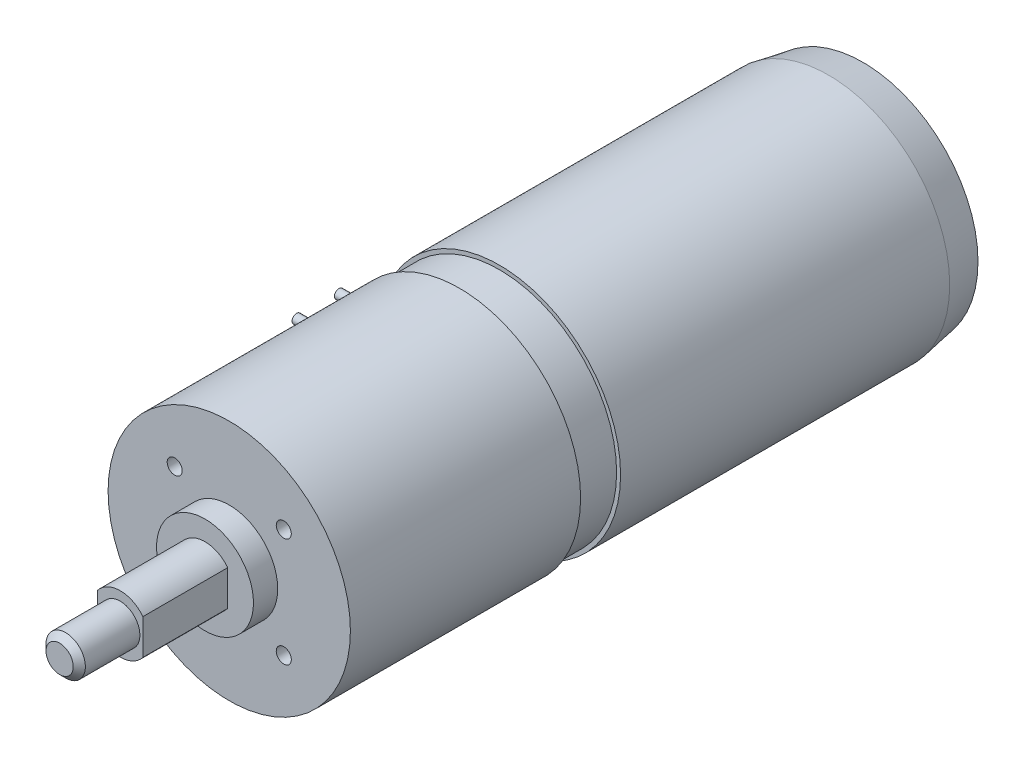
ISO-10303-21;
HEADER;
FILE_DESCRIPTION(('STEP AP214'),'2;1');
FILE_NAME('part.step','',(''),(''),'','','');
FILE_SCHEMA(('AUTOMOTIVE_DESIGN { 1 0 10303 214 1 1 1 1 }'));
ENDSEC;
DATA;
#1=APPLICATION_CONTEXT('core data for automotive mechanical design processes');
#2=APPLICATION_PROTOCOL_DEFINITION('international standard','automotive_design',2000,#1);
#3=PRODUCT_CONTEXT('',#1,'mechanical');
#4=PRODUCT('Part','Part','',(#3));
#5=PRODUCT_RELATED_PRODUCT_CATEGORY('part','',(#4));
#6=PRODUCT_DEFINITION_FORMATION('','',#4);
#7=PRODUCT_DEFINITION_CONTEXT('part definition',#1,'design');
#8=PRODUCT_DEFINITION('design','',#6,#7);
#9=PRODUCT_DEFINITION_SHAPE('','',#8);
#10=(LENGTH_UNIT() NAMED_UNIT(*) SI_UNIT(.MILLI.,.METRE.));
#11=(NAMED_UNIT(*) PLANE_ANGLE_UNIT() SI_UNIT($,.RADIAN.));
#12=(NAMED_UNIT(*) SI_UNIT($,.STERADIAN.) SOLID_ANGLE_UNIT());
#13=UNCERTAINTY_MEASURE_WITH_UNIT(LENGTH_MEASURE(1.E-05),#10,'distance_accuracy_value','');
#14=(GEOMETRIC_REPRESENTATION_CONTEXT(3) GLOBAL_UNCERTAINTY_ASSIGNED_CONTEXT((#13)) GLOBAL_UNIT_ASSIGNED_CONTEXT((#10,
#11,#12)) REPRESENTATION_CONTEXT('',''));
#15=CARTESIAN_POINT('',(0.,0.,0.));
#16=DIRECTION('',(0.,0.,1.));
#17=DIRECTION('',(1.,0.,0.));
#18=AXIS2_PLACEMENT_3D('',#15,#16,#17);
#19=CARTESIAN_POINT('',(0.,0.,132.6));
#20=DIRECTION('',(0.,0.,-1.));
#21=DIRECTION('',(-1.,0.,0.));
#22=AXIS2_PLACEMENT_3D('',#19,#20,#21);
#23=PLANE('',#22);
#24=CARTESIAN_POINT('',(0.,0.,132.600000000423));
#25=DIRECTION('',(0.,0.,-1.));
#26=DIRECTION('',(-1.,0.,0.));
#27=AXIS2_PLACEMENT_3D('',#24,#25,#26);
#28=CIRCLE('',#27,2.25000000040154);
#29=CARTESIAN_POINT('',(-2.25000000040154,0.,132.600000000423));
#30=VERTEX_POINT('',#29);
#31=EDGE_CURVE('E19',#30,#30,#28,.T.);
#32=ORIENTED_EDGE('',*,*,#31,.F.);
#33=EDGE_LOOP('',(#32));
#34=FACE_BOUND('',#33,.T.);
#35=ADVANCED_FACE('F15',(#34),#23,.F.);
#36=CARTESIAN_POINT('',(0.,0.,131.599999999423));
#37=DIRECTION('',(0.,0.,-1.));
#38=DIRECTION('',(-1.,0.,0.));
#39=AXIS2_PLACEMENT_3D('',#36,#37,#38);
#40=CONICAL_SURFACE('',#39,3.24999999958209,0.785398162487954);
#41=CARTESIAN_POINT('',(0.,0.,131.6));
#42=DIRECTION('',(0.,0.,1.));
#43=DIRECTION('',(0.,-1.,0.));
#44=AXIS2_PLACEMENT_3D('',#41,#42,#43);
#45=CIRCLE('',#44,3.25);
#46=CARTESIAN_POINT('',(0.,-3.25,131.6));
#47=VERTEX_POINT('',#46);
#48=EDGE_CURVE('E85',#47,#47,#45,.F.);
#49=ORIENTED_EDGE('',*,*,#48,.F.);
#50=EDGE_LOOP('',(#49));
#51=FACE_BOUND('',#50,.T.);
#52=ORIENTED_EDGE('',*,*,#31,.T.);
#53=EDGE_LOOP('',(#52));
#54=FACE_BOUND('',#53,.T.);
#55=ADVANCED_FACE('F209',(#51,#54),#40,.T.);
#56=CARTESIAN_POINT('',(0.,0.,122.6));
#57=DIRECTION('',(0.,0.,1.));
#58=DIRECTION('',(0.,-1.,0.));
#59=AXIS2_PLACEMENT_3D('',#56,#57,#58);
#60=CYLINDRICAL_SURFACE('',#59,3.25);
#61=ORIENTED_EDGE('',*,*,#48,.T.);
#62=EDGE_LOOP('',(#61));
#63=FACE_BOUND('',#62,.T.);
#64=CARTESIAN_POINT('',(0.,0.,122.6));
#65=DIRECTION('',(0.,0.,1.));
#66=DIRECTION('',(0.,-1.,0.));
#67=AXIS2_PLACEMENT_3D('',#64,#65,#66);
#68=CIRCLE('',#67,3.25);
#69=CARTESIAN_POINT('',(0.,-3.25,122.6));
#70=VERTEX_POINT('',#69);
#71=EDGE_CURVE('E68',#70,#70,#68,.F.);
#72=ORIENTED_EDGE('',*,*,#71,.F.);
#73=EDGE_LOOP('',(#72));
#74=FACE_BOUND('',#73,.T.);
#75=ADVANCED_FACE('F207',(#63,#74),#60,.T.);
#76=CARTESIAN_POINT('',(0.,0.,122.6));
#77=DIRECTION('',(0.,0.,1.));
#78=DIRECTION('',(1.,0.,0.));
#79=AXIS2_PLACEMENT_3D('',#76,#77,#78);
#80=PLANE('',#79);
#81=ORIENTED_EDGE('',*,*,#71,.T.);
#82=EDGE_LOOP('',(#81));
#83=FACE_BOUND('',#82,.T.);
#84=DIRECTION('',(0.,1.,0.));
#85=VECTOR('',#84,1.);
#86=CARTESIAN_POINT('',(-3.75,-2.91547594742265,122.6));
#87=LINE('',#86,#85);
#88=CARTESIAN_POINT('',(-3.75,-2.91547594742265,122.6));
#89=VERTEX_POINT('',#88);
#90=CARTESIAN_POINT('',(-3.75,2.91547594742265,122.6));
#91=VERTEX_POINT('',#90);
#92=EDGE_CURVE('E62',#89,#91,#87,.T.);
#93=ORIENTED_EDGE('',*,*,#92,.F.);
#94=CARTESIAN_POINT('',(0.,0.,122.6));
#95=DIRECTION('',(0.,0.,1.));
#96=DIRECTION('',(1.,0.,0.));
#97=AXIS2_PLACEMENT_3D('',#94,#95,#96);
#98=CIRCLE('',#97,4.75);
#99=CARTESIAN_POINT('',(3.75,-2.91547594742265,122.6));
#100=VERTEX_POINT('',#99);
#101=EDGE_CURVE('E77',#100,#89,#98,.F.);
#102=ORIENTED_EDGE('',*,*,#101,.F.);
#103=DIRECTION('',(0.,1.,0.));
#104=VECTOR('',#103,1.);
#105=CARTESIAN_POINT('',(3.75,2.91547594742265,122.6));
#106=LINE('',#105,#104);
#107=CARTESIAN_POINT('',(3.75,2.91547594742265,122.6));
#108=VERTEX_POINT('',#107);
#109=EDGE_CURVE('E65',#108,#100,#106,.F.);
#110=ORIENTED_EDGE('',*,*,#109,.F.);
#111=CARTESIAN_POINT('',(0.,0.,122.6));
#112=DIRECTION('',(0.,0.,1.));
#113=DIRECTION('',(1.,0.,0.));
#114=AXIS2_PLACEMENT_3D('',#111,#112,#113);
#115=CIRCLE('',#114,4.75);
#116=EDGE_CURVE('E58',#91,#108,#115,.F.);
#117=ORIENTED_EDGE('',*,*,#116,.F.);
#118=EDGE_LOOP('',(#93,#102,#110,#117));
#119=FACE_BOUND('',#118,.T.);
#120=ADVANCED_FACE('F60',(#83,#119),#80,.T.);
#121=CARTESIAN_POINT('',(0.,0.,108.6));
#122=DIRECTION('',(0.,0.,1.));
#123=DIRECTION('',(1.,0.,0.));
#124=AXIS2_PLACEMENT_3D('',#121,#122,#123);
#125=CYLINDRICAL_SURFACE('',#124,4.75);
#126=CARTESIAN_POINT('',(0.,0.,108.6));
#127=DIRECTION('',(0.,0.,1.));
#128=DIRECTION('',(1.,0.,0.));
#129=AXIS2_PLACEMENT_3D('',#126,#127,#128);
#130=CIRCLE('',#129,4.75);
#131=CARTESIAN_POINT('',(3.75,2.91547594742265,108.6));
#132=VERTEX_POINT('',#131);
#133=CARTESIAN_POINT('',(-3.75,2.91547594742265,108.6));
#134=VERTEX_POINT('',#133);
#135=EDGE_CURVE('E74',#132,#134,#130,.T.);
#136=ORIENTED_EDGE('',*,*,#135,.T.);
#137=DIRECTION('',(0.,0.,1.));
#138=VECTOR('',#137,1.);
#139=CARTESIAN_POINT('',(-3.75,2.91547594742265,108.6));
#140=LINE('',#139,#138);
#141=EDGE_CURVE('E71',#91,#134,#140,.F.);
#142=ORIENTED_EDGE('',*,*,#141,.F.);
#143=ORIENTED_EDGE('',*,*,#116,.T.);
#144=DIRECTION('',(0.,0.,-1.));
#145=VECTOR('',#144,1.);
#146=CARTESIAN_POINT('',(3.75,2.91547594742265,108.6));
#147=LINE('',#146,#145);
#148=EDGE_CURVE('E202',#132,#108,#147,.F.);
#149=ORIENTED_EDGE('',*,*,#148,.F.);
#150=EDGE_LOOP('',(#136,#142,#143,#149));
#151=FACE_BOUND('',#150,.T.);
#152=ADVANCED_FACE('F72',(#151),#125,.T.);
#153=CARTESIAN_POINT('',(-3.75,-2.91547594742265,108.6));
#154=DIRECTION('',(-1.,0.,0.));
#155=DIRECTION('',(0.,0.,1.));
#156=AXIS2_PLACEMENT_3D('',#153,#154,#155);
#157=PLANE('',#156);
#158=DIRECTION('',(0.,1.,0.));
#159=VECTOR('',#158,1.);
#160=CARTESIAN_POINT('',(-3.75,0.,108.6));
#161=LINE('',#160,#159);
#162=CARTESIAN_POINT('',(-3.75,-2.91547594742265,108.6));
#163=VERTEX_POINT('',#162);
#164=EDGE_CURVE('E200',#134,#163,#161,.F.);
#165=ORIENTED_EDGE('',*,*,#164,.T.);
#166=DIRECTION('',(0.,0.,1.));
#167=VECTOR('',#166,1.);
#168=CARTESIAN_POINT('',(-3.75,-2.91547594742265,108.6));
#169=LINE('',#168,#167);
#170=EDGE_CURVE('E80',#89,#163,#169,.F.);
#171=ORIENTED_EDGE('',*,*,#170,.F.);
#172=ORIENTED_EDGE('',*,*,#92,.T.);
#173=ORIENTED_EDGE('',*,*,#141,.T.);
#174=EDGE_LOOP('',(#165,#171,#172,#173));
#175=FACE_BOUND('',#174,.T.);
#176=ADVANCED_FACE('F79',(#175),#157,.T.);
#177=CARTESIAN_POINT('',(0.,0.,108.6));
#178=DIRECTION('',(0.,0.,1.));
#179=DIRECTION('',(1.,0.,0.));
#180=AXIS2_PLACEMENT_3D('',#177,#178,#179);
#181=CYLINDRICAL_SURFACE('',#180,4.75);
#182=CARTESIAN_POINT('',(0.,0.,108.6));
#183=DIRECTION('',(0.,0.,1.));
#184=DIRECTION('',(1.,0.,0.));
#185=AXIS2_PLACEMENT_3D('',#182,#183,#184);
#186=CIRCLE('',#185,4.75);
#187=CARTESIAN_POINT('',(3.75,-2.91547594742265,108.6));
#188=VERTEX_POINT('',#187);
#189=EDGE_CURVE('E34',#163,#188,#186,.T.);
#190=ORIENTED_EDGE('',*,*,#189,.T.);
#191=DIRECTION('',(0.,0.,-1.));
#192=VECTOR('',#191,1.);
#193=CARTESIAN_POINT('',(3.75,-2.91547594742265,108.6));
#194=LINE('',#193,#192);
#195=EDGE_CURVE('E503',#100,#188,#194,.T.);
#196=ORIENTED_EDGE('',*,*,#195,.F.);
#197=ORIENTED_EDGE('',*,*,#101,.T.);
#198=ORIENTED_EDGE('',*,*,#170,.T.);
#199=EDGE_LOOP('',(#190,#196,#197,#198));
#200=FACE_BOUND('',#199,.T.);
#201=ADVANCED_FACE('F295',(#200),#181,.T.);
#202=CARTESIAN_POINT('',(3.75,2.91547594742265,108.6));
#203=DIRECTION('',(1.,0.,0.));
#204=DIRECTION('',(0.,0.,-1.));
#205=AXIS2_PLACEMENT_3D('',#202,#203,#204);
#206=PLANE('',#205);
#207=DIRECTION('',(0.,1.,0.));
#208=VECTOR('',#207,1.);
#209=CARTESIAN_POINT('',(3.75,0.,108.6));
#210=LINE('',#209,#208);
#211=EDGE_CURVE('E199',#188,#132,#210,.T.);
#212=ORIENTED_EDGE('',*,*,#211,.T.);
#213=ORIENTED_EDGE('',*,*,#148,.T.);
#214=ORIENTED_EDGE('',*,*,#109,.T.);
#215=ORIENTED_EDGE('',*,*,#195,.T.);
#216=EDGE_LOOP('',(#212,#213,#214,#215));
#217=FACE_BOUND('',#216,.T.);
#218=ADVANCED_FACE('F228',(#217),#206,.T.);
#219=CARTESIAN_POINT('',(9.00000000000001,-9.,96.6));
#220=DIRECTION('',(0.,0.,1.));
#221=DIRECTION('',(1.,0.,0.));
#222=AXIS2_PLACEMENT_3D('',#219,#220,#221);
#223=CONICAL_SURFACE('',#222,1.24349999999999,1.02974425867666);
#224=CARTESIAN_POINT('',(9.,-9.,95.8528298202392));
#225=VERTEX_POINT('',#224);
#226=VERTEX_LOOP('',#225);
#227=FACE_BOUND('',#226,.T.);
#228=CARTESIAN_POINT('',(9.,-9.,96.6));
#229=DIRECTION('',(0.,0.,1.));
#230=DIRECTION('',(1.,0.,0.));
#231=AXIS2_PLACEMENT_3D('',#228,#229,#230);
#232=CIRCLE('',#231,1.2435);
#233=CARTESIAN_POINT('',(10.2435,-9.,96.6));
#234=VERTEX_POINT('',#233);
#235=EDGE_CURVE('E504',#234,#234,#232,.T.);
#236=ORIENTED_EDGE('',*,*,#235,.T.);
#237=EDGE_LOOP('',(#236));
#238=FACE_BOUND('',#237,.T.);
#239=ADVANCED_FACE('F224',(#227,#238),#223,.F.);
#240=CARTESIAN_POINT('',(-9.,9.,96.6));
#241=DIRECTION('',(0.,0.,1.));
#242=DIRECTION('',(1.,0.,0.));
#243=AXIS2_PLACEMENT_3D('',#240,#241,#242);
#244=CONICAL_SURFACE('',#243,1.24349999999999,1.02974425867666);
#245=CARTESIAN_POINT('',(-9.,9.,95.8528298202392));
#246=VERTEX_POINT('',#245);
#247=VERTEX_LOOP('',#246);
#248=FACE_BOUND('',#247,.T.);
#249=CARTESIAN_POINT('',(-9.,9.,96.6));
#250=DIRECTION('',(0.,0.,1.));
#251=DIRECTION('',(1.,0.,0.));
#252=AXIS2_PLACEMENT_3D('',#249,#250,#251);
#253=CIRCLE('',#252,1.2435);
#254=CARTESIAN_POINT('',(-7.7565,9.,96.6));
#255=VERTEX_POINT('',#254);
#256=EDGE_CURVE('E516',#255,#255,#253,.T.);
#257=ORIENTED_EDGE('',*,*,#256,.T.);
#258=EDGE_LOOP('',(#257));
#259=FACE_BOUND('',#258,.T.);
#260=ADVANCED_FACE('F227',(#248,#259),#244,.F.);
#261=CARTESIAN_POINT('',(9.,9.,96.6));
#262=DIRECTION('',(0.,0.,1.));
#263=DIRECTION('',(1.,0.,0.));
#264=AXIS2_PLACEMENT_3D('',#261,#262,#263);
#265=CONICAL_SURFACE('',#264,1.24349999999999,1.02974425867666);
#266=CARTESIAN_POINT('',(9.,9.,95.8528298202392));
#267=VERTEX_POINT('',#266);
#268=VERTEX_LOOP('',#267);
#269=FACE_BOUND('',#268,.T.);
#270=CARTESIAN_POINT('',(9.,9.,96.6));
#271=DIRECTION('',(0.,0.,1.));
#272=DIRECTION('',(1.,0.,0.));
#273=AXIS2_PLACEMENT_3D('',#270,#271,#272);
#274=CIRCLE('',#273,1.2435);
#275=CARTESIAN_POINT('',(10.2435,9.,96.6));
#276=VERTEX_POINT('',#275);
#277=EDGE_CURVE('E260',#276,#276,#274,.T.);
#278=ORIENTED_EDGE('',*,*,#277,.T.);
#279=EDGE_LOOP('',(#278));
#280=FACE_BOUND('',#279,.T.);
#281=ADVANCED_FACE('F232',(#269,#280),#265,.F.);
#282=CARTESIAN_POINT('',(-9.,-9.,96.6));
#283=DIRECTION('',(0.,0.,1.));
#284=DIRECTION('',(1.,0.,0.));
#285=AXIS2_PLACEMENT_3D('',#282,#283,#284);
#286=CONICAL_SURFACE('',#285,1.24349999999999,1.02974425867666);
#287=CARTESIAN_POINT('',(-9.,-9.,95.8528298202392));
#288=VERTEX_POINT('',#287);
#289=VERTEX_LOOP('',#288);
#290=FACE_BOUND('',#289,.T.);
#291=CARTESIAN_POINT('',(-9.,-9.,96.6));
#292=DIRECTION('',(0.,0.,1.));
#293=DIRECTION('',(1.,0.,0.));
#294=AXIS2_PLACEMENT_3D('',#291,#292,#293);
#295=CIRCLE('',#294,1.2435);
#296=CARTESIAN_POINT('',(-7.7565,-9.,96.6));
#297=VERTEX_POINT('',#296);
#298=EDGE_CURVE('E197',#297,#297,#295,.T.);
#299=ORIENTED_EDGE('',*,*,#298,.T.);
#300=EDGE_LOOP('',(#299));
#301=FACE_BOUND('',#300,.T.);
#302=ADVANCED_FACE('F236',(#290,#301),#286,.F.);
#303=CARTESIAN_POINT('',(0.,0.,108.6));
#304=DIRECTION('',(0.,0.,-1.));
#305=DIRECTION('',(-1.,0.,0.));
#306=AXIS2_PLACEMENT_3D('',#303,#304,#305);
#307=PLANE('',#306);
#308=ORIENTED_EDGE('',*,*,#189,.F.);
#309=ORIENTED_EDGE('',*,*,#164,.F.);
#310=ORIENTED_EDGE('',*,*,#135,.F.);
#311=ORIENTED_EDGE('',*,*,#211,.F.);
#312=EDGE_LOOP('',(#308,#309,#310,#311));
#313=FACE_BOUND('',#312,.T.);
#314=CARTESIAN_POINT('',(0.,0.,108.6));
#315=DIRECTION('',(0.,0.,1.));
#316=DIRECTION('',(1.,0.,0.));
#317=AXIS2_PLACEMENT_3D('',#314,#315,#316);
#318=CIRCLE('',#317,8.);
#319=CARTESIAN_POINT('',(8.,0.,108.6));
#320=VERTEX_POINT('',#319);
#321=EDGE_CURVE('E194',#320,#320,#318,.F.);
#322=ORIENTED_EDGE('',*,*,#321,.F.);
#323=EDGE_LOOP('',(#322));
#324=FACE_BOUND('',#323,.T.);
#325=ADVANCED_FACE('F240',(#313,#324),#307,.F.);
#326=CARTESIAN_POINT('',(9.,-9.,104.6));
#327=DIRECTION('',(0.,0.,-1.));
#328=DIRECTION('',(0.,1.,0.));
#329=AXIS2_PLACEMENT_3D('',#326,#327,#328);
#330=CYLINDRICAL_SURFACE('',#329,1.2435);
#331=ORIENTED_EDGE('',*,*,#235,.F.);
#332=EDGE_LOOP('',(#331));
#333=FACE_BOUND('',#332,.T.);
#334=CARTESIAN_POINT('',(9.,-9.,104.6));
#335=DIRECTION('',(0.,0.,-1.));
#336=DIRECTION('',(0.,1.,0.));
#337=AXIS2_PLACEMENT_3D('',#334,#335,#336);
#338=CIRCLE('',#337,1.2435);
#339=CARTESIAN_POINT('',(9.,-7.7565,104.6));
#340=VERTEX_POINT('',#339);
#341=EDGE_CURVE('E191',#340,#340,#338,.F.);
#342=ORIENTED_EDGE('',*,*,#341,.T.);
#343=EDGE_LOOP('',(#342));
#344=FACE_BOUND('',#343,.T.);
#345=ADVANCED_FACE('F242',(#333,#344),#330,.F.);
#346=CARTESIAN_POINT('',(-9.,9.,104.6));
#347=DIRECTION('',(0.,0.,-1.));
#348=DIRECTION('',(-1.,0.,0.));
#349=AXIS2_PLACEMENT_3D('',#346,#347,#348);
#350=CYLINDRICAL_SURFACE('',#349,1.2435);
#351=ORIENTED_EDGE('',*,*,#256,.F.);
#352=EDGE_LOOP('',(#351));
#353=FACE_BOUND('',#352,.T.);
#354=CARTESIAN_POINT('',(-9.,9.,104.6));
#355=DIRECTION('',(0.,0.,-1.));
#356=DIRECTION('',(-1.,0.,0.));
#357=AXIS2_PLACEMENT_3D('',#354,#355,#356);
#358=CIRCLE('',#357,1.2435);
#359=CARTESIAN_POINT('',(-10.2435,9.,104.6));
#360=VERTEX_POINT('',#359);
#361=EDGE_CURVE('E188',#360,#360,#358,.F.);
#362=ORIENTED_EDGE('',*,*,#361,.T.);
#363=EDGE_LOOP('',(#362));
#364=FACE_BOUND('',#363,.T.);
#365=ADVANCED_FACE('F245',(#353,#364),#350,.F.);
#366=CARTESIAN_POINT('',(9.,9.,104.6));
#367=DIRECTION('',(0.,0.,-1.));
#368=DIRECTION('',(-1.,0.,0.));
#369=AXIS2_PLACEMENT_3D('',#366,#367,#368);
#370=CYLINDRICAL_SURFACE('',#369,1.2435);
#371=ORIENTED_EDGE('',*,*,#277,.F.);
#372=EDGE_LOOP('',(#371));
#373=FACE_BOUND('',#372,.T.);
#374=CARTESIAN_POINT('',(9.,9.,104.6));
#375=DIRECTION('',(0.,0.,-1.));
#376=DIRECTION('',(-1.,0.,0.));
#377=AXIS2_PLACEMENT_3D('',#374,#375,#376);
#378=CIRCLE('',#377,1.2435);
#379=CARTESIAN_POINT('',(7.7565,9.,104.6));
#380=VERTEX_POINT('',#379);
#381=EDGE_CURVE('E185',#380,#380,#378,.F.);
#382=ORIENTED_EDGE('',*,*,#381,.T.);
#383=EDGE_LOOP('',(#382));
#384=FACE_BOUND('',#383,.T.);
#385=ADVANCED_FACE('F248',(#373,#384),#370,.F.);
#386=CARTESIAN_POINT('',(-9.,-9.,104.6));
#387=DIRECTION('',(0.,0.,-1.));
#388=DIRECTION('',(-1.,0.,0.));
#389=AXIS2_PLACEMENT_3D('',#386,#387,#388);
#390=CYLINDRICAL_SURFACE('',#389,1.2435);
#391=ORIENTED_EDGE('',*,*,#298,.F.);
#392=EDGE_LOOP('',(#391));
#393=FACE_BOUND('',#392,.T.);
#394=CARTESIAN_POINT('',(-9.,-9.,104.6));
#395=DIRECTION('',(0.,0.,-1.));
#396=DIRECTION('',(-1.,0.,0.));
#397=AXIS2_PLACEMENT_3D('',#394,#395,#396);
#398=CIRCLE('',#397,1.2435);
#399=CARTESIAN_POINT('',(-10.2435,-9.,104.6));
#400=VERTEX_POINT('',#399);
#401=EDGE_CURVE('E182',#400,#400,#398,.F.);
#402=ORIENTED_EDGE('',*,*,#401,.T.);
#403=EDGE_LOOP('',(#402));
#404=FACE_BOUND('',#403,.T.);
#405=ADVANCED_FACE('F17',(#393,#404),#390,.F.);
#406=CARTESIAN_POINT('',(0.,0.,104.6));
#407=DIRECTION('',(0.,0.,1.));
#408=DIRECTION('',(1.,0.,0.));
#409=AXIS2_PLACEMENT_3D('',#406,#407,#408);
#410=CYLINDRICAL_SURFACE('',#409,8.);
#411=CARTESIAN_POINT('',(0.,0.,104.6));
#412=DIRECTION('',(0.,0.,1.));
#413=DIRECTION('',(1.,0.,0.));
#414=AXIS2_PLACEMENT_3D('',#411,#412,#413);
#415=CIRCLE('',#414,8.);
#416=CARTESIAN_POINT('',(8.,0.,104.6));
#417=VERTEX_POINT('',#416);
#418=EDGE_CURVE('E179',#417,#417,#415,.T.);
#419=ORIENTED_EDGE('',*,*,#418,.T.);
#420=EDGE_LOOP('',(#419));
#421=FACE_BOUND('',#420,.T.);
#422=ORIENTED_EDGE('',*,*,#321,.T.);
#423=EDGE_LOOP('',(#422));
#424=FACE_BOUND('',#423,.T.);
#425=ADVANCED_FACE('F255',(#421,#424),#410,.T.);
#426=CARTESIAN_POINT('',(0.,0.,104.6));
#427=DIRECTION('',(0.,0.,-1.));
#428=DIRECTION('',(-1.,0.,0.));
#429=AXIS2_PLACEMENT_3D('',#426,#427,#428);
#430=PLANE('',#429);
#431=ORIENTED_EDGE('',*,*,#418,.F.);
#432=EDGE_LOOP('',(#431));
#433=FACE_BOUND('',#432,.T.);
#434=ORIENTED_EDGE('',*,*,#401,.F.);
#435=EDGE_LOOP('',(#434));
#436=FACE_BOUND('',#435,.T.);
#437=ORIENTED_EDGE('',*,*,#381,.F.);
#438=EDGE_LOOP('',(#437));
#439=FACE_BOUND('',#438,.T.);
#440=ORIENTED_EDGE('',*,*,#361,.F.);
#441=EDGE_LOOP('',(#440));
#442=FACE_BOUND('',#441,.T.);
#443=ORIENTED_EDGE('',*,*,#341,.F.);
#444=EDGE_LOOP('',(#443));
#445=FACE_BOUND('',#444,.T.);
#446=CARTESIAN_POINT('',(0.,0.,104.6));
#447=DIRECTION('',(0.,0.,1.));
#448=DIRECTION('',(1.,0.,0.));
#449=AXIS2_PLACEMENT_3D('',#446,#447,#448);
#450=CIRCLE('',#449,20.);
#451=CARTESIAN_POINT('',(20.,0.,104.6));
#452=VERTEX_POINT('',#451);
#453=EDGE_CURVE('E174',#452,#452,#450,.F.);
#454=ORIENTED_EDGE('',*,*,#453,.F.);
#455=EDGE_LOOP('',(#454));
#456=FACE_BOUND('',#455,.T.);
#457=ADVANCED_FACE('F263',(#433,#436,#439,#442,#445,#456),#430,.F.);
#458=CARTESIAN_POINT('',(0.,0.,66.6));
#459=DIRECTION('',(0.,0.,1.));
#460=DIRECTION('',(1.,0.,0.));
#461=AXIS2_PLACEMENT_3D('',#458,#459,#460);
#462=CYLINDRICAL_SURFACE('',#461,20.);
#463=CARTESIAN_POINT('',(0.,0.,66.6));
#464=DIRECTION('',(0.,0.,1.));
#465=DIRECTION('',(1.,0.,0.));
#466=AXIS2_PLACEMENT_3D('',#463,#464,#465);
#467=CIRCLE('',#466,20.);
#468=CARTESIAN_POINT('',(20.,0.,66.6));
#469=VERTEX_POINT('',#468);
#470=EDGE_CURVE('E170',#469,#469,#467,.F.);
#471=ORIENTED_EDGE('',*,*,#470,.F.);
#472=EDGE_LOOP('',(#471));
#473=FACE_BOUND('',#472,.T.);
#474=ORIENTED_EDGE('',*,*,#453,.T.);
#475=EDGE_LOOP('',(#474));
#476=FACE_BOUND('',#475,.T.);
#477=ADVANCED_FACE('F266',(#473,#476),#462,.T.);
#478=CARTESIAN_POINT('',(-29.0949596081637,0.,64.3902476677739));
#479=DIRECTION('',(-1.,0.,0.));
#480=DIRECTION('',(0.,0.,1.));
#481=AXIS2_PLACEMENT_3D('',#478,#479,#480);
#482=PLANE('',#481);
#483=CARTESIAN_POINT('',(-29.0949596081637,0.,64.3902476677739));
#484=DIRECTION('',(-1.,0.,0.));
#485=DIRECTION('',(0.,0.,1.));
#486=AXIS2_PLACEMENT_3D('',#483,#484,#485);
#487=CIRCLE('',#486,0.75);
#488=CARTESIAN_POINT('',(-29.0949596081637,0.,65.1402476677739));
#489=VERTEX_POINT('',#488);
#490=EDGE_CURVE('E168',#489,#489,#487,.F.);
#491=ORIENTED_EDGE('',*,*,#490,.F.);
#492=EDGE_LOOP('',(#491));
#493=FACE_BOUND('',#492,.T.);
#494=ADVANCED_FACE('F276',(#493),#482,.T.);
#495=CARTESIAN_POINT('',(0.,0.,66.6));
#496=DIRECTION('',(0.,0.,-1.));
#497=DIRECTION('',(-1.,0.,0.));
#498=AXIS2_PLACEMENT_3D('',#495,#496,#497);
#499=PLANE('',#498);
#500=CARTESIAN_POINT('',(0.,0.,66.6));
#501=DIRECTION('',(0.,0.,1.));
#502=DIRECTION('',(1.,0.,0.));
#503=AXIS2_PLACEMENT_3D('',#500,#501,#502);
#504=CIRCLE('',#503,19.3449596081637);
#505=CARTESIAN_POINT('',(19.3449596081637,0.,66.6));
#506=VERTEX_POINT('',#505);
#507=EDGE_CURVE('E140',#506,#506,#504,.F.);
#508=ORIENTED_EDGE('',*,*,#507,.F.);
#509=EDGE_LOOP('',(#508));
#510=FACE_BOUND('',#509,.T.);
#511=ORIENTED_EDGE('',*,*,#470,.T.);
#512=EDGE_LOOP('',(#511));
#513=FACE_BOUND('',#512,.T.);
#514=ADVANCED_FACE('F282',(#510,#513),#499,.T.);
#515=CARTESIAN_POINT('',(-19.0949596081637,0.,64.3902476677739));
#516=DIRECTION('',(-1.,0.,0.));
#517=DIRECTION('',(0.,0.,1.));
#518=AXIS2_PLACEMENT_3D('',#515,#516,#517);
#519=CYLINDRICAL_SURFACE('',#518,0.75);
#520=CARTESIAN_POINT('',(-19.3304154699656,-0.749999999999998,64.3902476677739));
#521=CARTESIAN_POINT('',(-19.3304156658862,-0.749998137800023,64.3481368272284));
#522=CARTESIAN_POINT('',(-19.3305545546189,-0.746441446727102,64.3059958552986));
#523=CARTESIAN_POINT('',(-19.3310952228737,-0.732303108883832,64.2228756612563));
#524=CARTESIAN_POINT('',(-19.3314973148022,-0.721713113791248,64.181897880162));
#525=CARTESIAN_POINT('',(-19.3325187732277,-0.693811139470051,64.1023202247467));
#526=CARTESIAN_POINT('',(-19.3331380317332,-0.676502500798857,64.0637191797293));
#527=CARTESIAN_POINT('',(-19.33452390793,-0.635659488844363,63.9899811964981));
#528=CARTESIAN_POINT('',(-19.3352904900855,-0.612126616389217,63.9548434259965));
#529=CARTESIAN_POINT('',(-19.3368852241691,-0.559485302977585,63.8889953498296));
#530=CARTESIAN_POINT('',(-19.3377134112019,-0.530373667931144,63.8582875982874));
#531=CARTESIAN_POINT('',(-19.3393376943763,-0.467407241886559,63.8021928909262));
#532=CARTESIAN_POINT('',(-19.3401337892269,-0.43355226032445,63.776806148981));
#533=CARTESIAN_POINT('',(-19.3416043885638,-0.362048462237919,63.7320683742166));
#534=CARTESIAN_POINT('',(-19.3422788569275,-0.324398523788038,63.7127191332646));
#535=CARTESIAN_POINT('',(-19.3434298626466,-0.246381495631746,63.680617174114));
#536=CARTESIAN_POINT('',(-19.3439064010607,-0.206014420461224,63.6678644206294));
#537=CARTESIAN_POINT('',(-19.3446076196904,-0.123730683295503,63.6493236447226));
#538=CARTESIAN_POINT('',(-19.3448324275496,-0.0818148177861844,63.6435320924098));
#539=CARTESIAN_POINT('',(-19.3450052745887,0.00239474383165684,63.6390672347805));
#540=CARTESIAN_POINT('',(-19.3449533152777,0.0446884378786453,63.6403938906487));
#541=CARTESIAN_POINT('',(-19.3445785926261,0.128429190281396,63.6501248385996));
#542=CARTESIAN_POINT('',(-19.3442559748341,0.169876691415301,63.6585253266847));
#543=CARTESIAN_POINT('',(-19.3433764547962,0.250772754053123,63.6821595893886));
#544=CARTESIAN_POINT('',(-19.3428195518582,0.290221309651246,63.6973933841949));
#545=CARTESIAN_POINT('',(-19.3415339634087,0.366011936096926,63.734266183993));
#546=CARTESIAN_POINT('',(-19.3408052312543,0.40235315980657,63.7559069285523));
#547=CARTESIAN_POINT('',(-19.3392580882319,0.470888254346449,63.8049780460161));
#548=CARTESIAN_POINT('',(-19.3384396769973,0.50308210822672,63.8324084425812));
#549=CARTESIAN_POINT('',(-19.3368047471194,0.562430774838448,63.8923017364228));
#550=CARTESIAN_POINT('',(-19.3359882300759,0.589582257394922,63.9247679337464));
#551=CARTESIAN_POINT('',(-19.3344496841995,0.63804980714986,63.9937996124236));
#552=CARTESIAN_POINT('',(-19.3337276553851,0.659365873201059,64.0303650945832));
#553=CARTESIAN_POINT('',(-19.3324595436421,0.695557171026741,64.1065593091935));
#554=CARTESIAN_POINT('',(-19.3319134638415,0.710432288297992,64.146188096087));
#555=CARTESIAN_POINT('',(-19.3310589541775,0.733317264777976,64.2273831335232));
#556=CARTESIAN_POINT('',(-19.3307505232377,0.741327155084235,64.2689493752889));
#557=CARTESIAN_POINT('',(-19.3304062873877,0.750250207843636,64.3528104218685));
#558=CARTESIAN_POINT('',(-19.3303703051141,0.751167987251988,64.3951047347301));
#559=CARTESIAN_POINT('',(-19.3305745612048,0.745892803823939,64.4792468090468));
#560=CARTESIAN_POINT('',(-19.3308147990258,0.739699854976859,64.5210945713805));
#561=CARTESIAN_POINT('',(-19.3315442534432,0.720382836006066,64.6031427250154));
#562=CARTESIAN_POINT('',(-19.3320333944628,0.707260869760899,64.6433436123719));
#563=CARTESIAN_POINT('',(-19.3332054540662,0.674460431521971,64.720972111293));
#564=CARTESIAN_POINT('',(-19.3338883733166,0.654781936973875,64.758399713317));
#565=CARTESIAN_POINT('',(-19.3353714419655,0.609415160894407,64.8294404669022));
#566=CARTESIAN_POINT('',(-19.3361716518826,0.583723772779741,64.8630516333113));
#567=CARTESIAN_POINT('',(-19.3377988860218,0.52706504633637,64.9254854669103));
#568=CARTESIAN_POINT('',(-19.3386259103511,0.496097686920238,64.9543081149602));
#569=CARTESIAN_POINT('',(-19.3402140661666,0.429746271289496,65.0063621930108));
#570=CARTESIAN_POINT('',(-19.3409751624091,0.394359877128178,65.0295906441367));
#571=CARTESIAN_POINT('',(-19.342345171694,0.320186759364338,65.0697765973508));
#572=CARTESIAN_POINT('',(-19.3429540852004,0.281400046127312,65.0867341185544));
#573=CARTESIAN_POINT('',(-19.3439509260484,0.201538477322388,65.1138916274541));
#574=CARTESIAN_POINT('',(-19.3443389161915,0.160464275662514,65.1240935356888));
#575=CARTESIAN_POINT('',(-19.3448504271331,0.0771844617512461,65.1374565178237));
#576=CARTESIAN_POINT('',(-19.3449739486381,0.0349788525224769,65.1406176105321));
#577=CARTESIAN_POINT('',(-19.344942603838,-0.0493360478919309,65.1398090140066));
#578=CARTESIAN_POINT('',(-19.3447879203592,-0.0914453841374062,65.1358440077899));
#579=CARTESIAN_POINT('',(-19.344217948378,-0.174400162810182,65.1209054201038));
#580=CARTESIAN_POINT('',(-19.3438026593677,-0.21524560277366,65.1099318249728));
#581=CARTESIAN_POINT('',(-19.3427582325215,-0.29451446248214,65.0812883866125));
#582=CARTESIAN_POINT('',(-19.3421290916783,-0.332937848157075,65.0636184492129));
#583=CARTESIAN_POINT('',(-19.3407277993599,-0.406272348081276,65.0220850252079));
#584=CARTESIAN_POINT('',(-19.3399556527612,-0.441183582033202,64.9982217497857));
#585=CARTESIAN_POINT('',(-19.3383547617041,-0.506525471853367,64.9449633766425));
#586=CARTESIAN_POINT('',(-19.3375259863591,-0.536953653543642,64.9155652444914));
#587=CARTESIAN_POINT('',(-19.3359053700793,-0.592451537744981,64.8520693486374));
#588=CARTESIAN_POINT('',(-19.3351135383181,-0.617519914799243,64.81797042587));
#589=CARTESIAN_POINT('',(-19.333655739323,-0.661593653767154,64.7460225044104));
#590=CARTESIAN_POINT('',(-19.3329898688038,-0.680594364484985,64.7081706578848));
#591=CARTESIAN_POINT('',(-19.3318607425966,-0.711948695178244,64.6298404479156));
#592=CARTESIAN_POINT('',(-19.3313972462808,-0.724310213364354,64.5893652698345));
#593=CARTESIAN_POINT('',(-19.3308485906136,-0.73877192819331,64.522237926923));
#594=CARTESIAN_POINT('',(-19.330686880019,-0.742977127974468,64.4960211402677));
#595=CARTESIAN_POINT('',(-19.3304702580136,-0.748591749704792,64.443289443725));
#596=CARTESIAN_POINT('',(-19.3304153465494,-0.750001173054939,64.4167745339869));
#597=CARTESIAN_POINT('',(-19.3304154699656,-0.749999999999998,64.3902476677739));
#598=B_SPLINE_CURVE_WITH_KNOTS('',3,(#520,#521,#522,#523,#524,#525,#526,#527,#528,#529,#530,
#531,#532,#533,#534,#535,#536,#537,#538,#539,#540,#541,#542,#543,#544,#545,#546,#547,#548,#549,
#550,#551,#552,#553,#554,#555,#556,#557,#558,#559,#560,#561,#562,#563,#564,#565,#566,#567,#568,
#569,#570,#571,#572,#573,#574,#575,#576,#577,#578,#579,#580,#581,#582,#583,#584,#585,#586,#587,
#588,#589,#590,#591,#592,#593,#594,#595,#596,#597),.UNSPECIFIED.,.T.,.F.,(4,2,2,2,2,2,2,2,2,2,2,
2,2,2,2,2,2,2,2,2,2,2,2,2,2,2,2,2,2,2,2,2,2,2,2,2,2,2,4),(0.,0.12623569260053,0.252621491639102,
0.378944531085174,0.505237138415083,0.63160227109602,0.757972481953173,0.88438016257113,
1.0107871669986,1.13713004579766,1.26347223565644,1.38974652756816,1.51602119252977,
1.64233017414482,1.76863967195804,1.89503229502083,2.02142494293287,2.14781983768357,
2.2742141598983,2.40052619263183,2.52683797686528,2.65311143070341,2.77938531892433,
2.90572459159018,3.03206436923088,3.15847127399548,3.28487779343607,3.41124836159606,
3.53761859218287,3.66390580714138,3.79019326826708,3.91648250543171,4.04276743689319,
4.1691218054875,4.29550738492886,4.42198961450933,4.54832104133134,4.62784068433945,
4.70736028749975),.UNSPECIFIED.);
#599=CARTESIAN_POINT('',(-19.3304154699656,-0.749999999999998,64.3902476677739));
#600=VERTEX_POINT('',#599);
#601=EDGE_CURVE('E133',#600,#600,#598,.T.);
#602=ORIENTED_EDGE('',*,*,#601,.F.);
#603=EDGE_LOOP('',(#602));
#604=FACE_BOUND('',#603,.T.);
#605=ORIENTED_EDGE('',*,*,#490,.T.);
#606=EDGE_LOOP('',(#605));
#607=FACE_BOUND('',#606,.T.);
#608=ADVANCED_FACE('F142',(#604,#607),#519,.T.);
#609=CARTESIAN_POINT('',(0.,0.,60.));
#610=DIRECTION('',(0.,0.,1.));
#611=DIRECTION('',(1.,0.,0.));
#612=AXIS2_PLACEMENT_3D('',#609,#610,#611);
#613=CYLINDRICAL_SURFACE('',#612,19.3449596081637);
#614=CARTESIAN_POINT('',(0.,0.,60.));
#615=DIRECTION('',(0.,0.,1.));
#616=DIRECTION('',(1.,0.,0.));
#617=AXIS2_PLACEMENT_3D('',#614,#615,#616);
#618=CIRCLE('',#617,19.3449596081637);
#619=CARTESIAN_POINT('',(19.3449596081637,0.,60.));
#620=VERTEX_POINT('',#619);
#621=EDGE_CURVE('E128',#620,#620,#618,.T.);
#622=ORIENTED_EDGE('',*,*,#621,.T.);
#623=EDGE_LOOP('',(#622));
#624=FACE_BOUND('',#623,.T.);
#625=ORIENTED_EDGE('',*,*,#601,.T.);
#626=EDGE_LOOP('',(#625));
#627=FACE_BOUND('',#626,.T.);
#628=ORIENTED_EDGE('',*,*,#507,.T.);
#629=EDGE_LOOP('',(#628));
#630=FACE_BOUND('',#629,.T.);
#631=ADVANCED_FACE('F145',(#624,#627,#630),#613,.T.);
#632=CARTESIAN_POINT('',(-29.0949596081637,0.049817499167278,57.392195783118));
#633=DIRECTION('',(-1.,0.,0.));
#634=DIRECTION('',(0.,0.,1.));
#635=AXIS2_PLACEMENT_3D('',#632,#633,#634);
#636=PLANE('',#635);
#637=CARTESIAN_POINT('',(-29.0949596081637,0.049817499167278,57.392195783118));
#638=DIRECTION('',(-1.,0.,0.));
#639=DIRECTION('',(0.,0.,1.));
#640=AXIS2_PLACEMENT_3D('',#637,#638,#639);
#641=CIRCLE('',#640,0.75);
#642=CARTESIAN_POINT('',(-29.0949596081637,0.049817499167278,58.142195783118));
#643=VERTEX_POINT('',#642);
#644=EDGE_CURVE('E126',#643,#643,#641,.F.);
#645=ORIENTED_EDGE('',*,*,#644,.F.);
#646=EDGE_LOOP('',(#645));
#647=FACE_BOUND('',#646,.T.);
#648=ADVANCED_FACE('F149',(#647),#636,.T.);
#649=CARTESIAN_POINT('',(0.,0.,0.));
#650=DIRECTION('',(0.,0.,-1.));
#651=DIRECTION('',(-1.,0.,0.));
#652=AXIS2_PLACEMENT_3D('',#649,#650,#651);
#653=PLANE('',#652);
#654=CARTESIAN_POINT('',(0.,0.,-9.97153748460988E-11));
#655=DIRECTION('',(0.,0.,1.));
#656=DIRECTION('',(1.,0.,0.));
#657=AXIS2_PLACEMENT_3D('',#654,#655,#656);
#658=CIRCLE('',#657,19.0000000005655);
#659=CARTESIAN_POINT('',(19.0000000005655,0.,-9.97153748460988E-11));
#660=VERTEX_POINT('',#659);
#661=EDGE_CURVE('E118',#660,#660,#658,.T.);
#662=ORIENTED_EDGE('',*,*,#661,.F.);
#663=EDGE_LOOP('',(#662));
#664=FACE_BOUND('',#663,.T.);
#665=ADVANCED_FACE('F153',(#664),#653,.T.);
#666=CARTESIAN_POINT('',(0.,0.,60.));
#667=DIRECTION('',(0.,0.,-1.));
#668=DIRECTION('',(-1.,0.,0.));
#669=AXIS2_PLACEMENT_3D('',#666,#667,#668);
#670=PLANE('',#669);
#671=ORIENTED_EDGE('',*,*,#621,.F.);
#672=EDGE_LOOP('',(#671));
#673=FACE_BOUND('',#672,.T.);
#674=CARTESIAN_POINT('',(0.,0.,60.));
#675=DIRECTION('',(0.,0.,1.));
#676=DIRECTION('',(1.,0.,0.));
#677=AXIS2_PLACEMENT_3D('',#674,#675,#676);
#678=CIRCLE('',#677,20.);
#679=CARTESIAN_POINT('',(20.,0.,60.));
#680=VERTEX_POINT('',#679);
#681=EDGE_CURVE('E96',#680,#680,#678,.F.);
#682=ORIENTED_EDGE('',*,*,#681,.F.);
#683=EDGE_LOOP('',(#682));
#684=FACE_BOUND('',#683,.T.);
#685=ADVANCED_FACE('F113',(#673,#684),#670,.F.);
#686=CARTESIAN_POINT('',(-19.0949596081637,0.049817499167278,57.392195783118));
#687=DIRECTION('',(-1.,0.,0.));
#688=DIRECTION('',(0.,0.,1.));
#689=AXIS2_PLACEMENT_3D('',#686,#687,#688);
#690=CYLINDRICAL_SURFACE('',#689,0.75);
#691=CARTESIAN_POINT('',(-19.9877398538586,-0.700182500832722,57.392195783118));
#692=CARTESIAN_POINT('',(-19.9877400387392,-0.700180638684766,57.3500814261053));
#693=CARTESIAN_POINT('',(-19.9878655158357,-0.696623359469738,57.3079369112477));
#694=CARTESIAN_POINT('',(-19.988353250031,-0.682482581291301,57.224809583341));
#695=CARTESIAN_POINT('',(-19.9887157887285,-0.671890725920224,57.1838282124417));
#696=CARTESIAN_POINT('',(-19.9896342887983,-0.643983538501464,57.1042433680369));
#697=CARTESIAN_POINT('',(-19.9901901547875,-0.626671521536321,57.0656387329404));
#698=CARTESIAN_POINT('',(-19.9914289198885,-0.585820197493983,56.9918941967393));
#699=CARTESIAN_POINT('',(-19.9921117882594,-0.562282396790868,56.9567534603384));
#700=CARTESIAN_POINT('',(-19.9935231253624,-0.509632036677071,56.8909033893556));
#701=CARTESIAN_POINT('',(-19.9942516163329,-0.480516744105945,56.8601962403738));
#702=CARTESIAN_POINT('',(-19.9956657249479,-0.417542852523238,56.804103590697));
#703=CARTESIAN_POINT('',(-19.9963513408906,-0.383684065405469,56.7787183011434));
#704=CARTESIAN_POINT('',(-19.9975954267608,-0.31217651369155,56.7339866738486));
#705=CARTESIAN_POINT('',(-19.9981538713575,-0.274526996181647,56.7146415389427));
#706=CARTESIAN_POINT('',(-19.9990725590943,-0.196512143941409,56.6825474365749));
#707=CARTESIAN_POINT('',(-19.999432803281,-0.156146823551611,56.6697984342858));
#708=CARTESIAN_POINT('',(-19.9999058615971,-0.0738670318469751,56.6512641758883));
#709=CARTESIAN_POINT('',(-20.0000187954205,-0.0319533199193132,56.6454755516904));
#710=CARTESIAN_POINT('',(-19.9999760547394,0.0522507874769153,56.6410156319398));
#711=CARTESIAN_POINT('',(-19.9998203815346,0.0945411811219878,56.6423443019514));
#712=CARTESIAN_POINT('',(-19.9992492224584,0.178278933255447,56.6520785008851));
#713=CARTESIAN_POINT('',(-19.9988338495044,0.21972665005636,56.6604809546808));
#714=CARTESIAN_POINT('',(-19.9977814668612,0.30062249704506,56.6841190971242));
#715=CARTESIAN_POINT('',(-19.9971444564258,0.340070620499137,56.6993548087815));
#716=CARTESIAN_POINT('',(-19.99571197014,0.41586247535036,56.7362325435661));
#717=CARTESIAN_POINT('',(-19.9949164409701,0.452205156303033,56.7578767234493));
#718=CARTESIAN_POINT('',(-19.993248972798,0.520742345894605,56.8069553851969));
#719=CARTESIAN_POINT('',(-19.9923770334905,0.552936837961875,56.8343898901919));
#720=CARTESIAN_POINT('',(-19.9906475859616,0.612285150919834,56.8942913150646));
#721=CARTESIAN_POINT('',(-19.9897900872545,0.639435758297167,56.9267614191739));
#722=CARTESIAN_POINT('',(-19.9881810713848,0.687900687671345,56.9958011875362));
#723=CARTESIAN_POINT('',(-19.9874295542067,0.709215010517395,57.0323708511926));
#724=CARTESIAN_POINT('',(-19.9861128631509,0.745400611408026,57.1085710202745));
#725=CARTESIAN_POINT('',(-19.9855476805122,0.760272192386806,57.1482013816843));
#726=CARTESIAN_POINT('',(-19.9846643327438,0.783149855510945,57.2293991380501));
#727=CARTESIAN_POINT('',(-19.9843461664275,0.791155970635738,57.2709665237003));
#728=CARTESIAN_POINT('',(-19.9839912591075,0.800071052125103,57.3548273328291));
#729=CARTESIAN_POINT('',(-19.9839543220158,0.800984963555817,57.3971202298175));
#730=CARTESIAN_POINT('',(-19.9841653343023,0.795702589168605,57.4812588323677));
#731=CARTESIAN_POINT('',(-19.9844132830821,0.789506318282094,57.5231045388685));
#732=CARTESIAN_POINT('',(-19.9851672475492,0.770183460489577,57.6051475198498));
#733=CARTESIAN_POINT('',(-19.9856731819819,0.757059055606885,57.6453453090505));
#734=CARTESIAN_POINT('',(-19.9868887750686,0.724254750459238,57.7229672041172));
#735=CARTESIAN_POINT('',(-19.9875984344327,0.704574827345017,57.760391300315));
#736=CARTESIAN_POINT('',(-19.9891460841179,0.659205835582535,57.8314256427874));
#737=CARTESIAN_POINT('',(-19.9899841434597,0.633513531069065,57.8650338208166));
#738=CARTESIAN_POINT('',(-19.9916992958202,0.576853918362425,57.9274616200673));
#739=CARTESIAN_POINT('',(-19.9925763890077,0.545886587367314,57.9562812205885));
#740=CARTESIAN_POINT('',(-19.9942778521232,0.479534251344033,58.0083309090822));
#741=CARTESIAN_POINT('',(-19.9951021908091,0.444146664505889,58.0315577069715));
#742=CARTESIAN_POINT('',(-19.9966120974502,0.369971439245897,58.0717401834867));
#743=CARTESIAN_POINT('',(-19.9972976657656,0.331183809648086,58.0886958783871));
#744=CARTESIAN_POINT('',(-19.998460753851,0.251318070470003,58.1158504591923));
#745=CARTESIAN_POINT('',(-19.9989383202986,0.21024047711582,58.1260508613171));
#746=CARTESIAN_POINT('',(-19.9996404061198,0.126953631053966,58.1394098016643));
#747=CARTESIAN_POINT('',(-19.9998649261496,0.0847443812817977,58.1425683581515));
#748=CARTESIAN_POINT('',(-20.0000444070847,0.000422124573246253,58.1417534276228));
#749=CARTESIAN_POINT('',(-19.999999545463,-0.0416909274460975,58.1377846374281));
#750=CARTESIAN_POINT('',(-19.9996545744637,-0.124652952241065,58.1228370045231));
#751=CARTESIAN_POINT('',(-19.9993544647229,-0.165501923217385,58.1118581518349));
#752=CARTESIAN_POINT('',(-19.99854140431,-0.244773654670682,58.0832038947978));
#753=CARTESIAN_POINT('',(-19.9980284691351,-0.283196591567286,58.0655289780382));
#754=CARTESIAN_POINT('',(-19.9968555862313,-0.356529442477032,58.0239852888674));
#755=CARTESIAN_POINT('',(-19.9961956436179,-0.391439478670329,58.000116731977));
#756=CARTESIAN_POINT('',(-19.9948100003913,-0.456774870982394,57.9468502571794));
#757=CARTESIAN_POINT('',(-19.9940842697349,-0.487198161330315,57.9174498063877));
#758=CARTESIAN_POINT('',(-19.9926552646212,-0.542686013170202,57.8539505937326));
#759=CARTESIAN_POINT('',(-19.9919519957601,-0.567749247946292,57.8198506720872));
#760=CARTESIAN_POINT('',(-19.9906521307566,-0.611813071349408,57.747901746426));
#761=CARTESIAN_POINT('',(-19.9900556183002,-0.63080891284543,57.7100498370441));
#762=CARTESIAN_POINT('',(-19.9890420134658,-0.662153792995863,57.6317209909288));
#763=CARTESIAN_POINT('',(-19.9886247080265,-0.674510729137215,57.5912472376226));
#764=CARTESIAN_POINT('',(-19.9881304261091,-0.688963688059271,57.5241320251153));
#765=CARTESIAN_POINT('',(-19.9879846332677,-0.693165427470261,57.4979257711964));
#766=CARTESIAN_POINT('',(-19.98778928896,-0.698775419512898,57.4452155908339));
#767=CARTESIAN_POINT('',(-19.9877397374548,-0.70018367327124,57.4187116645105));
#768=CARTESIAN_POINT('',(-19.9877398538586,-0.700182500832722,57.392195783118));
#769=B_SPLINE_CURVE_WITH_KNOTS('',3,(#691,#692,#693,#694,#695,#696,#697,#698,#699,#700,#701,
#702,#703,#704,#705,#706,#707,#708,#709,#710,#711,#712,#713,#714,#715,#716,#717,#718,#719,#720,
#721,#722,#723,#724,#725,#726,#727,#728,#729,#730,#731,#732,#733,#734,#735,#736,#737,#738,#739,
#740,#741,#742,#743,#744,#745,#746,#747,#748,#749,#750,#751,#752,#753,#754,#755,#756,#757,#758,
#759,#760,#761,#762,#763,#764,#765,#766,#767,#768),.UNSPECIFIED.,.T.,.F.,(4,2,2,2,2,2,2,2,2,2,2,
2,2,2,2,2,2,2,2,2,2,2,2,2,2,2,2,2,2,2,2,2,2,2,2,2,2,2,4),(0.,0.126246288536176,
0.252642814538504,0.378977067705921,0.5052807812912,0.63164654704793,0.758017325335876,
0.884413253050929,1.01080851339672,1.13714258711113,1.26347604958176,1.38975462051299,
1.51603361666392,1.64235516013552,1.76867720823433,1.89507946351361,2.0214817004008,
2.14787799327873,2.27427367898717,2.40058122689514,2.52688850955719,2.6531560353172,
2.77942400118741,2.90576008143945,3.03209670780834,3.15850747375656,3.28491791164413,
3.4112999671881,3.53768169493015,3.66398016944885,3.79027882373361,3.91656828305909,
4.04285334846509,4.16919637725698,4.29557064225413,4.42204354169523,4.548365656924,
4.62785239732976,4.70733910567619),.UNSPECIFIED.);
#770=CARTESIAN_POINT('',(-19.9877398538586,-0.700182500832722,57.392195783118));
#771=VERTEX_POINT('',#770);
#772=EDGE_CURVE('E25',#771,#771,#769,.T.);
#773=ORIENTED_EDGE('',*,*,#772,.F.);
#774=EDGE_LOOP('',(#773));
#775=FACE_BOUND('',#774,.T.);
#776=ORIENTED_EDGE('',*,*,#644,.T.);
#777=EDGE_LOOP('',(#776));
#778=FACE_BOUND('',#777,.T.);
#779=ADVANCED_FACE('F98',(#775,#778),#690,.T.);
#780=CARTESIAN_POINT('',(0.,0.,5.67128181971742));
#781=DIRECTION('',(0.,0.,1.));
#782=DIRECTION('',(1.,0.,0.));
#783=AXIS2_PLACEMENT_3D('',#780,#781,#782);
#784=CONICAL_SURFACE('',#783,19.9999999994345,0.174532925);
#785=ORIENTED_EDGE('',*,*,#661,.T.);
#786=EDGE_LOOP('',(#785));
#787=FACE_BOUND('',#786,.T.);
#788=CARTESIAN_POINT('',(0.,0.,5.67128181961771));
#789=DIRECTION('',(0.,0.,1.));
#790=DIRECTION('',(1.,0.,0.));
#791=AXIS2_PLACEMENT_3D('',#788,#789,#790);
#792=CIRCLE('',#791,20.);
#793=CARTESIAN_POINT('',(20.,0.,5.67128181961771));
#794=VERTEX_POINT('',#793);
#795=EDGE_CURVE('E9',#794,#794,#792,.T.);
#796=ORIENTED_EDGE('',*,*,#795,.F.);
#797=EDGE_LOOP('',(#796));
#798=FACE_BOUND('',#797,.T.);
#799=ADVANCED_FACE('F105',(#787,#798),#784,.T.);
#800=CARTESIAN_POINT('',(0.,0.,0.));
#801=DIRECTION('',(0.,0.,1.));
#802=DIRECTION('',(1.,0.,0.));
#803=AXIS2_PLACEMENT_3D('',#800,#801,#802);
#804=CYLINDRICAL_SURFACE('',#803,20.);
#805=ORIENTED_EDGE('',*,*,#795,.T.);
#806=EDGE_LOOP('',(#805));
#807=FACE_BOUND('',#806,.T.);
#808=ORIENTED_EDGE('',*,*,#772,.T.);
#809=EDGE_LOOP('',(#808));
#810=FACE_BOUND('',#809,.T.);
#811=ORIENTED_EDGE('',*,*,#681,.T.);
#812=EDGE_LOOP('',(#811));
#813=FACE_BOUND('',#812,.T.);
#814=ADVANCED_FACE('F102',(#807,#810,#813),#804,.T.);
#815=CLOSED_SHELL('',(#35,#55,#75,#120,#152,#176,#201,#218,#239,#260,#281,#302,#325,#345,#365,
#385,#405,#425,#457,#477,#494,#514,#608,#631,#648,#665,#685,#779,#799,#814));
#816=MANIFOLD_SOLID_BREP('B1',#815);
#817=ADVANCED_BREP_SHAPE_REPRESENTATION('',(#18,#816),#14);
#818=SHAPE_DEFINITION_REPRESENTATION(#9,#817);
ENDSEC;
END-ISO-10303-21;
